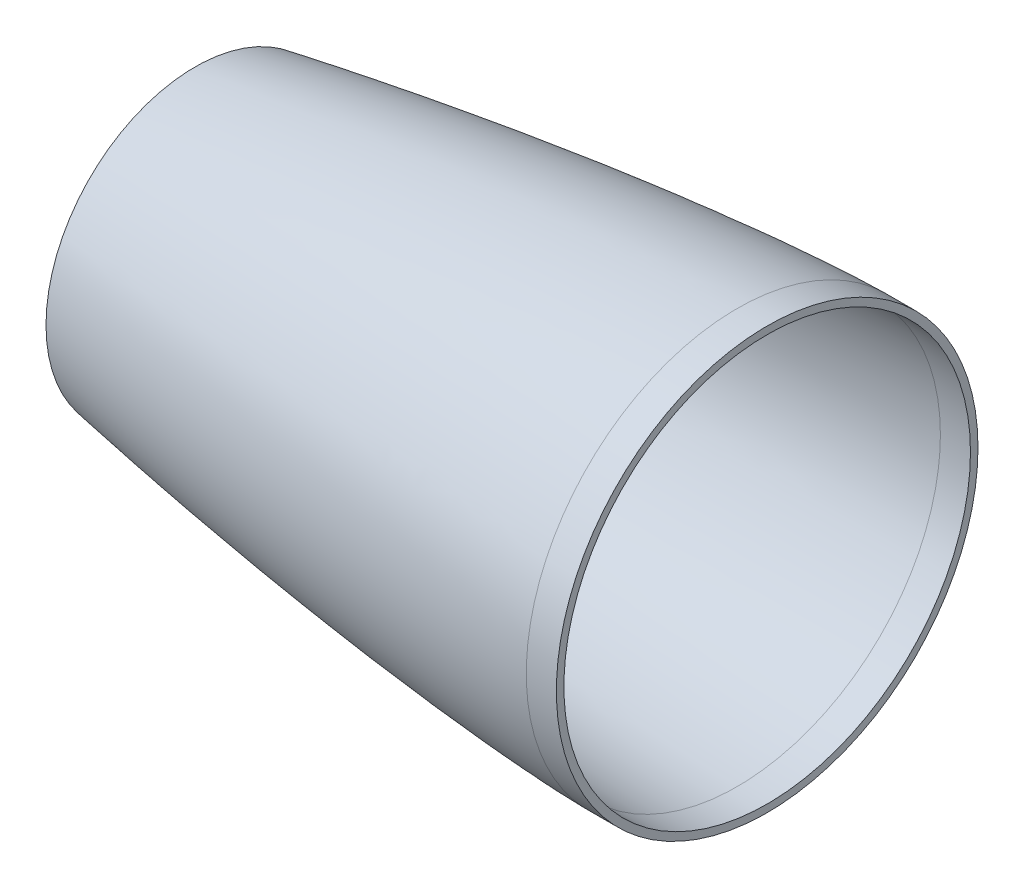
ISO-10303-21;
HEADER;
FILE_DESCRIPTION(('STEP AP214'),'2;1');
FILE_NAME('part.step','',(''),(''),'','','');
FILE_SCHEMA(('AUTOMOTIVE_DESIGN { 1 0 10303 214 1 1 1 1 }'));
ENDSEC;
DATA;
#1=APPLICATION_CONTEXT('core data for automotive mechanical design processes');
#2=APPLICATION_PROTOCOL_DEFINITION('international standard','automotive_design',2000,#1);
#3=PRODUCT_CONTEXT('',#1,'mechanical');
#4=PRODUCT('Part','Part','',(#3));
#5=PRODUCT_RELATED_PRODUCT_CATEGORY('part','',(#4));
#6=PRODUCT_DEFINITION_FORMATION('','',#4);
#7=PRODUCT_DEFINITION_CONTEXT('part definition',#1,'design');
#8=PRODUCT_DEFINITION('design','',#6,#7);
#9=PRODUCT_DEFINITION_SHAPE('','',#8);
#10=(LENGTH_UNIT() NAMED_UNIT(*) SI_UNIT(.MILLI.,.METRE.));
#11=(NAMED_UNIT(*) PLANE_ANGLE_UNIT() SI_UNIT($,.RADIAN.));
#12=(NAMED_UNIT(*) SI_UNIT($,.STERADIAN.) SOLID_ANGLE_UNIT());
#13=UNCERTAINTY_MEASURE_WITH_UNIT(LENGTH_MEASURE(1.E-05),#10,'distance_accuracy_value','');
#14=(GEOMETRIC_REPRESENTATION_CONTEXT(3) GLOBAL_UNCERTAINTY_ASSIGNED_CONTEXT((#13)) GLOBAL_UNIT_ASSIGNED_CONTEXT((#10,
#11,#12)) REPRESENTATION_CONTEXT('',''));
#15=CARTESIAN_POINT('',(0.,0.,0.));
#16=DIRECTION('',(0.,0.,1.));
#17=DIRECTION('',(1.,0.,0.));
#18=AXIS2_PLACEMENT_3D('',#15,#16,#17);
#19=CARTESIAN_POINT('',(457.2,88.9151474306752,0.));
#20=CARTESIAN_POINT('',(455.946325970131,88.9096070595816,0.));
#21=CARTESIAN_POINT('',(453.439259358558,88.8670591141968,0.));
#22=CARTESIAN_POINT('',(448.426238411328,88.7337773947161,0.));
#23=CARTESIAN_POINT('',(439.73839281718,88.3857521285292,0.));
#24=CARTESIAN_POINT('',(428.633298536274,87.7894164542894,0.));
#25=CARTESIAN_POINT('',(411.444893999551,86.6327793707619,0.));
#26=CARTESIAN_POINT('',(389.441443153579,84.7940694843695,0.));
#27=CARTESIAN_POINT('',(363.808737294308,82.2338961157606,0.));
#28=CARTESIAN_POINT('',(334.566457513105,78.8280593272444,0.));
#29=CARTESIAN_POINT('',(305.377643317541,74.992305893388,0.));
#30=CARTESIAN_POINT('',(276.244707872545,70.7535830300126,0.));
#31=CARTESIAN_POINT('',(247.171268660131,66.1243959171367,0.));
#32=CARTESIAN_POINT('',(218.162700889625,61.1047240595085,0.));
#33=CARTESIAN_POINT('',(189.226352810735,55.6834645782928,0.));
#34=CARTESIAN_POINT('',(160.373138085459,49.8354605300759,0.));
#35=CARTESIAN_POINT('',(131.618382458485,43.5190500386218,0.));
#36=CARTESIAN_POINT('',(102.986961257339,36.6637158027097,0.));
#37=CARTESIAN_POINT('',(75.2291315334263,29.34260403624,0.));
#38=CARTESIAN_POINT('',(51.2280847232855,22.2453278220032,0.));
#39=CARTESIAN_POINT('',(32.1609199731866,15.8309473459927,0.));
#40=CARTESIAN_POINT('',(18.8818526621386,10.6607161614939,0.));
#41=CARTESIAN_POINT('',(11.1356400070898,7.19917025164617,0.));
#42=CARTESIAN_POINT('',(6.41553741622741,4.76888097271789,0.));
#43=CARTESIAN_POINT('',(3.70040498934197,3.15649989124108,0.));
#44=CARTESIAN_POINT('',(2.1712436943493,2.11577541374487,0.));
#45=CARTESIAN_POINT('',(1.29726517344645,1.43712408397375,0.));
#46=CARTESIAN_POINT('',(0.796656587163147,0.996403728119644,0.));
#47=CARTESIAN_POINT('',(0.508236086993361,0.709975777371162,0.));
#48=CARTESIAN_POINT('',(0.336940369552542,0.5207345708639,0.));
#49=CARTESIAN_POINT('',(0.219057570584673,0.377905450824387,0.));
#50=CARTESIAN_POINT('',(0.133875618926122,0.263125341051019,0.));
#51=CARTESIAN_POINT('',(0.06950687304492,0.163021890873473,0.));
#52=CARTESIAN_POINT('',(0.025920332395015,0.0786931532777685,0.));
#53=CARTESIAN_POINT('',(0.00817122284619331,0.0346034081490176,0.));
#54=CARTESIAN_POINT('',(0.00225195502300941,0.0116765884656801,0.));
#55=CARTESIAN_POINT('',(0.,0.,0.));
#56=B_SPLINE_CURVE_WITH_KNOTS('',4,(#19,#20,#21,#22,#23,#24,#25,#26,#27,#28,#29,#30,#31,#32,#33,
#34,#35,#36,#37,#38,#39,#40,#41,#42,#43,#44,#45,#46,#47,#48,#49,#50,#51,#52,#53,#54,#55),
.UNSPECIFIED.,.F.,.F.,(5,1,1,1,1,1,1,1,1,1,1,1,1,1,1,1,1,1,1,1,1,1,1,1,1,1,1,1,1,1,1,1,1,5),(0.,
0.0107028585408144,0.0214057170816288,0.0428114341632575,0.0742270157557156,0.105642597348174,
0.168473764273532,0.231304932082114,0.294136099101199,0.356967264511137,0.419798428516133,
0.482629593130158,0.54546076349562,0.608291924387174,0.671123088525779,0.733954252495489,
0.796785426569319,0.859616580073358,0.916172283638337,0.947587760918424,0.968473522471574,
0.981230284106354,0.988574031772078,0.992887341044273,0.995416079253204,0.997012129469831,
0.998014752370499,0.998578001550583,0.998884285300425,0.999190569050268,0.999595284525134,
0.999797642262567,0.999898821131283,1.),.UNSPECIFIED.);
#57=CARTESIAN_POINT('',(457.2,0.,0.));
#58=DIRECTION('',(1.,0.,0.));
#59=AXIS1_PLACEMENT('',#57,#58);
#60=SURFACE_OF_REVOLUTION('',#56,#59);
#61=CARTESIAN_POINT('',(228.6,0.,0.));
#62=DIRECTION('',(1.,0.,0.));
#63=DIRECTION('',(0.,0.,-1.));
#64=AXIS2_PLACEMENT_3D('',#61,#62,#63);
#65=CIRCLE('',#64,62.8724960821944);
#66=CARTESIAN_POINT('',(228.6,0.,-62.8724960821944));
#67=VERTEX_POINT('',#66);
#68=EDGE_CURVE('E113',#67,#67,#65,.F.);
#69=ORIENTED_EDGE('',*,*,#68,.F.);
#70=EDGE_LOOP('',(#69));
#71=FACE_BOUND('',#70,.T.);
#72=CARTESIAN_POINT('',(457.2,0.,0.));
#73=DIRECTION('',(1.,0.,0.));
#74=DIRECTION('',(0.,0.,-1.));
#75=AXIS2_PLACEMENT_3D('',#72,#73,#74);
#76=CIRCLE('',#75,88.9151474306748);
#77=CARTESIAN_POINT('',(457.2,0.,-88.9151474306748));
#78=VERTEX_POINT('',#77);
#79=EDGE_CURVE('E43',#78,#78,#76,.T.);
#80=ORIENTED_EDGE('',*,*,#79,.F.);
#81=EDGE_LOOP('',(#80));
#82=FACE_BOUND('',#81,.T.);
#83=ADVANCED_FACE('F35',(#71,#82),#60,.F.);
#84=CARTESIAN_POINT('',(469.9,0.,0.));
#85=DIRECTION('',(1.,0.,0.));
#86=DIRECTION('',(0.,0.,-1.));
#87=AXIS2_PLACEMENT_3D('',#84,#85,#86);
#88=PLANE('',#87);
#89=CARTESIAN_POINT('',(469.9,0.,0.));
#90=DIRECTION('',(1.,0.,0.));
#91=DIRECTION('',(0.,0.,-1.));
#92=AXIS2_PLACEMENT_3D('',#89,#90,#91);
#93=CIRCLE('',#92,85.7401474306751);
#94=CARTESIAN_POINT('',(469.9,0.,-85.7401474306751));
#95=VERTEX_POINT('',#94);
#96=EDGE_CURVE('E47',#95,#95,#93,.T.);
#97=ORIENTED_EDGE('',*,*,#96,.F.);
#98=EDGE_LOOP('',(#97));
#99=FACE_BOUND('',#98,.T.);
#100=CARTESIAN_POINT('',(469.9,0.,0.));
#101=DIRECTION('',(1.,0.,0.));
#102=DIRECTION('',(0.,0.,-1.));
#103=AXIS2_PLACEMENT_3D('',#100,#101,#102);
#104=CIRCLE('',#103,88.9151474306753);
#105=CARTESIAN_POINT('',(469.9,0.,-88.9151474306753));
#106=VERTEX_POINT('',#105);
#107=EDGE_CURVE('E10',#106,#106,#104,.T.);
#108=ORIENTED_EDGE('',*,*,#107,.T.);
#109=EDGE_LOOP('',(#108));
#110=FACE_BOUND('',#109,.T.);
#111=ADVANCED_FACE('F78',(#99,#110),#88,.T.);
#112=CARTESIAN_POINT('',(457.2,0.,0.));
#113=DIRECTION('',(1.,0.,0.));
#114=DIRECTION('',(0.,0.,-1.));
#115=AXIS2_PLACEMENT_3D('',#112,#113,#114);
#116=CYLINDRICAL_SURFACE('',#115,88.9151474306751);
#117=ORIENTED_EDGE('',*,*,#79,.T.);
#118=EDGE_LOOP('',(#117));
#119=FACE_BOUND('',#118,.T.);
#120=ORIENTED_EDGE('',*,*,#107,.F.);
#121=EDGE_LOOP('',(#120));
#122=FACE_BOUND('',#121,.T.);
#123=ADVANCED_FACE('F76',(#119,#122),#116,.T.);
#124=CARTESIAN_POINT('',(457.2,88.9151474306752,0.));
#125=CARTESIAN_POINT('',(455.946325970131,88.9096070595816,0.));
#126=CARTESIAN_POINT('',(453.439259358558,88.8670591141968,0.));
#127=CARTESIAN_POINT('',(448.426238411328,88.7337773947161,0.));
#128=CARTESIAN_POINT('',(439.73839281718,88.3857521285292,0.));
#129=CARTESIAN_POINT('',(428.633298536274,87.7894164542894,0.));
#130=CARTESIAN_POINT('',(411.444893999551,86.6327793707619,0.));
#131=CARTESIAN_POINT('',(389.441443153579,84.7940694843695,0.));
#132=CARTESIAN_POINT('',(363.808737294308,82.2338961157606,0.));
#133=CARTESIAN_POINT('',(334.566457513105,78.8280593272444,0.));
#134=CARTESIAN_POINT('',(305.377643317541,74.992305893388,0.));
#135=CARTESIAN_POINT('',(276.244707872545,70.7535830300126,0.));
#136=CARTESIAN_POINT('',(247.171268660131,66.1243959171367,0.));
#137=CARTESIAN_POINT('',(218.162700889625,61.1047240595085,0.));
#138=CARTESIAN_POINT('',(189.226352810735,55.6834645782928,0.));
#139=CARTESIAN_POINT('',(160.373138085459,49.8354605300759,0.));
#140=CARTESIAN_POINT('',(131.618382458485,43.5190500386218,0.));
#141=CARTESIAN_POINT('',(102.986961257339,36.6637158027097,0.));
#142=CARTESIAN_POINT('',(75.2291315334263,29.34260403624,0.));
#143=CARTESIAN_POINT('',(51.2280847232855,22.2453278220032,0.));
#144=CARTESIAN_POINT('',(32.1609199731866,15.8309473459927,0.));
#145=CARTESIAN_POINT('',(18.8818526621386,10.6607161614939,0.));
#146=CARTESIAN_POINT('',(11.1356400070898,7.19917025164617,0.));
#147=CARTESIAN_POINT('',(6.56443195126468,4.84554388103954,0.));
#148=CARTESIAN_POINT('',(4.24353193294884,3.47834755188173,0.));
#149=CARTESIAN_POINT('',(3.23765947503868,2.82723498943833,0.));
#150=CARTESIAN_POINT('',(2.95679087341137,2.63945943168812,0.));
#151=B_SPLINE_CURVE_WITH_KNOTS('',4,(#124,#125,#126,#127,#128,#129,#130,#131,#132,#133,#134,
#135,#136,#137,#138,#139,#140,#141,#142,#143,#144,#145,#146,#147,#148,#149,#150),.UNSPECIFIED.,
.F.,.F.,(5,1,1,1,1,1,1,1,1,1,1,1,1,1,1,1,1,1,1,1,1,1,1,5),(0.,0.0107028585408144,
0.0214057170816288,0.0428114341632575,0.0742270157557156,0.105642597348174,0.168473764273532,
0.231304932082114,0.294136099101199,0.356967264511137,0.419798428516133,0.482629593130158,
0.54546076349562,0.608291924387174,0.671123088525779,0.733954252495489,0.796785426569319,
0.859616580073358,0.916172283638337,0.947587760918424,0.968473522471574,0.981230284106354,
0.988574031772078,0.991458376357514),.UNSPECIFIED.);
#152=CARTESIAN_POINT('',(457.2,0.,0.));
#153=DIRECTION('',(1.,0.,0.));
#154=AXIS1_PLACEMENT('',#152,#153);
#155=SURFACE_OF_REVOLUTION('',#151,#154);
#156=OFFSET_SURFACE('',#155,3.175,.F.);
#157=CARTESIAN_POINT('',(228.6,0.,0.));
#158=DIRECTION('',(1.,0.,0.));
#159=DIRECTION('',(0.,0.,-1.));
#160=AXIS2_PLACEMENT_3D('',#157,#158,#159);
#161=CIRCLE('',#160,59.6491220098759);
#162=CARTESIAN_POINT('',(228.6,0.,-59.6491220098759));
#163=VERTEX_POINT('',#162);
#164=EDGE_CURVE('E39',#163,#163,#161,.F.);
#165=ORIENTED_EDGE('',*,*,#164,.T.);
#166=EDGE_LOOP('',(#165));
#167=FACE_BOUND('',#166,.T.);
#168=CARTESIAN_POINT('',(457.214031164219,0.,-85.7401784345383));
#169=CARTESIAN_POINT('',(457.214031164152,1.40292180575902,-85.7402081939915));
#170=CARTESIAN_POINT('',(457.214031164156,2.80584107928027,-85.7057466471904));
#171=CARTESIAN_POINT('',(457.214031164201,5.60830122533601,-85.5680546220737));
#172=CARTESIAN_POINT('',(457.214031164242,7.00784209787054,-85.4648241437591));
#173=CARTESIAN_POINT('',(457.214031164254,9.8001721053742,-85.1898079366197));
#174=CARTESIAN_POINT('',(457.214031164225,11.1929612403438,-85.0180222078003));
#175=CARTESIAN_POINT('',(457.214031164187,13.9684328828145,-84.6063187274703));
#176=CARTESIAN_POINT('',(457.214031164177,15.3511153903144,-84.3664009759524));
#177=CARTESIAN_POINT('',(457.214031164188,18.1030426508934,-83.819008919495));
#178=CARTESIAN_POINT('',(457.214031164207,19.4722874039728,-83.5115346145577));
#179=CARTESIAN_POINT('',(457.214031164205,22.1940405581952,-82.8297708573391));
#180=CARTESIAN_POINT('',(457.214031164183,23.5465489593396,-82.455481405063));
#181=CARTESIAN_POINT('',(457.214031164191,26.2315710898439,-81.6409888687209));
#182=CARTESIAN_POINT('',(457.21403116422,27.5640848192022,-81.2007857846493));
#183=CARTESIAN_POINT('',(457.214031164236,30.2059074660631,-80.2555265208975));
#184=CARTESIAN_POINT('',(457.214031164222,31.5152163835665,-79.7504703412193));
#185=CARTESIAN_POINT('',(457.214031164207,34.1074751662925,-78.6767215978475));
#186=CARTESIAN_POINT('',(457.214031164205,35.3904250315145,-78.1080290341522));
#187=CARTESIAN_POINT('',(457.214031164213,37.9268749711856,-76.9083775564403));
#188=CARTESIAN_POINT('',(457.214031164222,39.1803750456353,-76.2774186424251));
#189=CARTESIAN_POINT('',(457.214031164226,41.6549056122618,-74.9547544984277));
#190=CARTESIAN_POINT('',(457.214031164222,42.875936104439,-74.2630492684461));
#191=CARTESIAN_POINT('',(457.214031164224,45.2825859371492,-72.8205588712398));
#192=CARTESIAN_POINT('',(457.21403116423,46.4682052776819,-72.0697737040148));
#193=CARTESIAN_POINT('',(457.214031164238,48.801176546257,-70.5109321394844));
#194=CARTESIAN_POINT('',(457.21403116424,49.9485284742991,-69.7028757421787));
#195=CARTESIAN_POINT('',(457.214031164227,52.2022008466007,-68.031438396144));
#196=CARTESIAN_POINT('',(457.214031164211,53.3085212908599,-67.1680574474147));
#197=CARTESIAN_POINT('',(457.214031164204,55.4774654727964,-65.3880509588123));
#198=CARTESIAN_POINT('',(457.214031164213,56.5400892104713,-64.4714254189364));
#199=CARTESIAN_POINT('',(457.214031164226,58.6190800254749,-62.587137979335));
#200=CARTESIAN_POINT('',(457.21403116423,59.6354471028056,-61.6194760796117));
#201=CARTESIAN_POINT('',(457.214031164225,61.6194760798162,-59.635447102593));
#202=CARTESIAN_POINT('',(457.214031164215,62.587137979498,-58.6190800252996));
#203=CARTESIAN_POINT('',(457.214031164224,64.4714254189735,-56.5400892104259));
#204=CARTESIAN_POINT('',(457.214031164242,65.3880509587675,-55.477465472846));
#205=CARTESIAN_POINT('',(457.214031164246,67.168057447352,-53.3085212909419));
#206=CARTESIAN_POINT('',(457.214031164234,68.0314383961372,-52.2022008466134));
#207=CARTESIAN_POINT('',(457.214031164234,69.7028757422058,-49.948528474259));
#208=CARTESIAN_POINT('',(457.214031164246,70.5109321394939,-48.8011765462365));
#209=CARTESIAN_POINT('',(457.214031164222,72.0697737040188,-46.4682052776822));
#210=CARTESIAN_POINT('',(457.214031164185,72.8205588712549,-45.2825859371499));
#211=CARTESIAN_POINT('',(457.21403116418,74.2630492684307,-42.8759361044382));
#212=CARTESIAN_POINT('',(457.214031164213,74.9547544983708,-41.6549056122591));
#213=CARTESIAN_POINT('',(457.214031164235,76.2774186424902,-39.1803750456226));
#214=CARTESIAN_POINT('',(457.214031164225,76.9083775566681,-37.9268749711645));
#215=CARTESIAN_POINT('',(457.214031164214,78.1080290339546,-35.390425031472));
#216=CARTESIAN_POINT('',(457.214031164212,78.6767215970634,-34.1074751662375));
#217=CARTESIAN_POINT('',(457.214031164216,79.7504703420046,-31.5152163836184));
#218=CARTESIAN_POINT('',(457.214031164221,80.2555265238385,-30.2059074662343));
#219=CARTESIAN_POINT('',(457.214031164234,81.2007857816874,-27.5640848190895));
#220=CARTESIAN_POINT('',(457.214031164242,81.6409888576994,-26.2315710893277));
#221=CARTESIAN_POINT('',(457.214031164229,82.4554814160957,-23.5465489598204));
#222=CARTESIAN_POINT('',(457.214031164207,82.829770898482,-22.1940405600756));
#223=CARTESIAN_POINT('',(457.214031164206,83.5115345734853,-19.4722874018107));
#224=CARTESIAN_POINT('',(457.214031164227,83.8190087661047,-18.1030426432913));
#225=CARTESIAN_POINT('',(457.21403116423,84.3664011293389,-15.3511153979372));
#226=CARTESIAN_POINT('',(457.214031164211,84.6063192999514,-13.9684329111021));
#227=CARTESIAN_POINT('',(457.2140311642,85.0180216352834,-11.1929612122972));
#228=CARTESIAN_POINT('',(457.214031164208,85.1898057999989,-9.80017200032687));
#229=CARTESIAN_POINT('',(457.214031164194,85.4648262804035,-7.00784220267474));
#230=CARTESIAN_POINT('',(457.214031164171,85.5680625960991,-5.60830161699361));
#231=CARTESIAN_POINT('',(457.214031164186,85.705738673169,-2.80584068754182));
#232=CARTESIAN_POINT('',(457.214031164223,85.7401784345383,-1.40292034377093));
#233=CARTESIAN_POINT('',(457.214031164216,85.7401784345383,1.40292034377059));
#234=CARTESIAN_POINT('',(457.214031164173,85.705738673169,2.80584068754121));
#235=CARTESIAN_POINT('',(457.214031164185,85.5680625960952,5.60830161707506));
#236=CARTESIAN_POINT('',(457.214031164241,85.4648262803916,7.00784220283834));
#237=CARTESIAN_POINT('',(457.214031164255,85.1898057999872,9.80017200040711));
#238=CARTESIAN_POINT('',(457.214031164214,85.0180216352918,11.1929612122132));
#239=CARTESIAN_POINT('',(457.214031164198,84.6063192999911,13.9684329108618));
#240=CARTESIAN_POINT('',(457.214031164224,84.3664011293815,15.3511153977037));
#241=CARTESIAN_POINT('',(457.214031164233,83.8190087661229,18.1030426432196));
#242=CARTESIAN_POINT('',(457.214031164216,83.511534573469,19.4722874018924));
#243=CARTESIAN_POINT('',(457.214031164197,82.8297708984407,22.1940405602243));
#244=CARTESIAN_POINT('',(457.214031164196,82.4554814160754,23.5465489598856));
#245=CARTESIAN_POINT('',(457.214031164185,81.6409888577049,26.2315710893096));
#246=CARTESIAN_POINT('',(457.214031164174,81.2007857816935,27.5640848190705));
#247=CARTESIAN_POINT('',(457.214031164185,80.2555265238434,30.2059074662212));
#248=CARTESIAN_POINT('',(457.214031164208,79.7504703420073,31.5152163836119));
#249=CARTESIAN_POINT('',(457.21403116422,78.6767215970635,34.1074751662374));
#250=CARTESIAN_POINT('',(457.21403116421,78.1080290339547,35.3904250314718));
#251=CARTESIAN_POINT('',(457.214031164208,76.9083775566764,37.9268749711467));
#252=CARTESIAN_POINT('',(457.214031164216,76.2774186425078,39.1803750455876));
#253=CARTESIAN_POINT('',(457.214031164232,74.9547544983902,41.6549056122251));
#254=CARTESIAN_POINT('',(457.21403116424,74.263049268441,42.8759361044215));
#255=CARTESIAN_POINT('',(457.21403116423,72.8205588712315,45.2825859371893));
#256=CARTESIAN_POINT('',(457.21403116421,72.0697737039697,46.4682052777596));
#257=CARTESIAN_POINT('',(457.214031164179,70.5109321394177,48.801176546346));
#258=CARTESIAN_POINT('',(457.214031164168,69.7028757421303,49.9485284743638));
#259=CARTESIAN_POINT('',(457.214031164196,68.0314383961463,52.2022008465974));
#260=CARTESIAN_POINT('',(457.214031164237,67.1680574474506,53.3085212908139));
#261=CARTESIAN_POINT('',(457.214031164251,65.3880509589567,55.4774654726234));
#262=CARTESIAN_POINT('',(457.214031164226,64.4714254191579,56.5400892102159));
#263=CARTESIAN_POINT('',(457.214031164214,62.5871379795815,58.619080025214));
#264=CARTESIAN_POINT('',(457.214031164226,61.6194760797985,59.6354471026148));
#265=CARTESIAN_POINT('',(457.214031164228,59.635447102658,61.6194760797552));
#266=CARTESIAN_POINT('',(457.214031164217,58.6190800253027,62.587137979497));
#267=CARTESIAN_POINT('',(457.214031164223,56.5400892103365,64.4714254190526));
#268=CARTESIAN_POINT('',(457.214031164241,55.4774654727277,65.3880509588686));
#269=CARTESIAN_POINT('',(457.214031164247,53.3085212908924,67.1680574473886));
#270=CARTESIAN_POINT('',(457.214031164237,52.2022008466666,68.0314383960937));
#271=CARTESIAN_POINT('',(457.214031164231,49.9485284743674,69.7028757421295));
#272=CARTESIAN_POINT('',(457.214031164235,48.8011765462916,70.510932139457));
#273=CARTESIAN_POINT('',(457.214031164232,46.4682052776646,72.0697737040306));
#274=CARTESIAN_POINT('',(457.214031164224,45.2825859371142,72.8205588712777));
#275=CARTESIAN_POINT('',(457.214031164221,42.8759361043848,74.2630492684617));
#276=CARTESIAN_POINT('',(457.214031164226,41.6549056122065,74.9547544984));
#277=CARTESIAN_POINT('',(457.214031164222,39.1803750455878,76.2774186425077));
#278=CARTESIAN_POINT('',(457.214031164213,37.9268749711469,76.9083775566763));
#279=CARTESIAN_POINT('',(457.214031164206,35.390425031472,78.1080290339546));
#280=CARTESIAN_POINT('',(457.214031164208,34.1074751662375,78.6767215970634));
#281=CARTESIAN_POINT('',(457.21403116422,31.5152163836184,79.7504703420047));
#282=CARTESIAN_POINT('',(457.214031164231,30.2059074662343,80.2555265238385));
#283=CARTESIAN_POINT('',(457.214031164217,27.5640848190782,81.2007857816914));
#284=CARTESIAN_POINT('',(457.214031164193,26.231571089305,81.6409888577067));
#285=CARTESIAN_POINT('',(457.214031164181,23.5465489598741,82.4554814160785));
#286=CARTESIAN_POINT('',(457.214031164194,22.1940405602187,82.829770898442));
#287=CARTESIAN_POINT('',(457.214031164219,19.4722874019634,83.5115345734512));
#288=CARTESIAN_POINT('',(457.21403116423,18.1030426433621,83.8190087660909));
#289=CARTESIAN_POINT('',(457.214031164227,15.3511153978507,84.3664011293559));
#290=CARTESIAN_POINT('',(457.214031164213,13.9684329109401,84.6063192999794));
#291=CARTESIAN_POINT('',(457.214031164197,11.192961212137,85.0180216353032));
#292=CARTESIAN_POINT('',(457.214031164195,9.80017200024503,85.189805800007));
#293=CARTESIAN_POINT('',(457.214031164207,7.0078422025906,85.4648262804117));
#294=CARTESIAN_POINT('',(457.214031164219,5.60830161682807,85.5680625961115));
#295=CARTESIAN_POINT('',(457.214031164232,2.80584068737689,85.7057386731733));
#296=CARTESIAN_POINT('',(457.214031164232,1.4029203436884,85.7401784345384));
#297=CARTESIAN_POINT('',(457.214031164207,-1.40292034377093,85.7401784345382));
#298=CARTESIAN_POINT('',(457.214031164182,-2.80584068754178,85.705738673169));
#299=CARTESIAN_POINT('',(457.214031164175,-5.60830161699352,85.5680625960991));
#300=CARTESIAN_POINT('',(457.214031164191,-7.00784220267466,85.4648262804034));
#301=CARTESIAN_POINT('',(457.21403116421,-9.80017200024699,85.1898058000068));
#302=CARTESIAN_POINT('',(457.214031164213,-11.1929612121379,85.0180216353032));
#303=CARTESIAN_POINT('',(457.214031164199,-13.9684329109439,84.6063192999788));
#304=CARTESIAN_POINT('',(457.214031164183,-15.3511153978585,84.3664011293543));
#305=CARTESIAN_POINT('',(457.214031164181,-18.1030426433649,83.8190087660899));
#306=CARTESIAN_POINT('',(457.214031164194,-19.4722874019572,83.5115345734524));
#307=CARTESIAN_POINT('',(457.214031164219,-22.1940405602853,82.8297708984257));
#308=CARTESIAN_POINT('',(457.21403116423,-23.5465489600214,82.4554814160381));
#309=CARTESIAN_POINT('',(457.214031164235,-26.2315710894482,81.6409888576594));
#310=CARTESIAN_POINT('',(457.214031164229,-27.5640848191392,81.2007857816692));
#311=CARTESIAN_POINT('',(457.214031164219,-30.2059074662781,80.2555265238232));
#312=CARTESIAN_POINT('',(457.214031164214,-31.5152163837247,79.7504703419638));
#313=CARTESIAN_POINT('',(457.214031164214,-34.107475166348,78.6767215970145));
#314=CARTESIAN_POINT('',(457.214031164217,-35.3904250315265,78.1080290339288));
#315=CARTESIAN_POINT('',(457.214031164221,-37.9268749711468,76.9083775566764));
#316=CARTESIAN_POINT('',(457.214031164221,-39.1803750455876,76.2774186425078));
#317=CARTESIAN_POINT('',(457.214031164226,-41.6549056122064,74.9547544984001));
#318=CARTESIAN_POINT('',(457.214031164231,-42.8759361043846,74.2630492684618));
#319=CARTESIAN_POINT('',(457.214031164215,-45.2825859371338,72.8205588712659));
#320=CARTESIAN_POINT('',(457.214031164193,-46.4682052777032,72.069773704006));
#321=CARTESIAN_POINT('',(457.214031164196,-48.8011765464046,70.51093213938));
#322=CARTESIAN_POINT('',(457.21403116422,-49.9485284745346,69.702875742011));
#323=CARTESIAN_POINT('',(457.214031164247,-52.2022008467891,68.0314383959974));
#324=CARTESIAN_POINT('',(457.21403116425,-53.3085212909213,67.1680574473632));
#325=CARTESIAN_POINT('',(457.214031164238,-55.477465472688,65.3880509589028));
#326=CARTESIAN_POINT('',(457.214031164222,-56.5400892103171,64.4714254190702));
#327=CARTESIAN_POINT('',(457.214031164217,-58.619080025346,62.5871379794578));
#328=CARTESIAN_POINT('',(457.214031164228,-59.6354471027426,61.6194760796747));
#329=CARTESIAN_POINT('',(457.214031164227,-61.6194760798357,59.6354471025735));
#330=CARTESIAN_POINT('',(457.214031164215,-62.5871379795362,58.6190800252595));
#331=CARTESIAN_POINT('',(457.214031164224,-64.4714254190526,56.5400892103366));
#332=CARTESIAN_POINT('',(457.214031164244,-65.3880509588686,55.4774654727278));
#333=CARTESIAN_POINT('',(457.214031164244,-67.1680574474042,53.3085212908734));
#334=CARTESIAN_POINT('',(457.214031164223,-68.0314383961239,52.2022008466279));
#335=CARTESIAN_POINT('',(457.214031164217,-69.702875742144,49.9485284743456));
#336=CARTESIAN_POINT('',(457.214031164232,-70.5109321394442,48.8011765463087));
#337=CARTESIAN_POINT('',(457.214031164236,-72.0697737040061,46.4682052777034));
#338=CARTESIAN_POINT('',(457.214031164225,-72.8205588712659,45.2825859371339));
#339=CARTESIAN_POINT('',(457.21403116422,-74.2630492684617,42.8759361043847));
#340=CARTESIAN_POINT('',(457.214031164226,-74.9547544984001,41.6549056122065));
#341=CARTESIAN_POINT('',(457.214031164222,-76.2774186424994,39.1803750456033));
#342=CARTESIAN_POINT('',(457.214031164212,-76.9083775566605,37.9268749711784));
#343=CARTESIAN_POINT('',(457.214031164207,-78.1080290339077,35.3904250315732));
#344=CARTESIAN_POINT('',(457.214031164211,-78.6767215969949,34.1074751663933));
#345=CARTESIAN_POINT('',(457.214031164217,-79.7504703419471,31.5152163837672));
#346=CARTESIAN_POINT('',(457.214031164218,-80.2555265238078,30.2059074663191));
#347=CARTESIAN_POINT('',(457.21403116423,-81.200785781685,27.564084819097));
#348=CARTESIAN_POINT('',(457.214031164241,-81.6409888577011,26.231571089323));
#349=CARTESIAN_POINT('',(457.21403116423,-82.4554814160974,23.5465489598137));
#350=CARTESIAN_POINT('',(457.214031164207,-82.8297708984808,22.1940405600795));
#351=CARTESIAN_POINT('',(457.214031164206,-83.5115345735028,19.472287401742));
#352=CARTESIAN_POINT('',(457.214031164227,-83.8190087661393,18.1030426431381));
#353=CARTESIAN_POINT('',(457.21403116423,-84.3664011293825,15.3511153976974));
#354=CARTESIAN_POINT('',(457.214031164212,-84.6063192999912,13.9684329108609));
#355=CARTESIAN_POINT('',(457.2140311642,-85.0180216353035,11.192961212135));
#356=CARTESIAN_POINT('',(457.214031164207,-85.1898058000069,9.80017200024558));
#357=CARTESIAN_POINT('',(457.214031164195,-85.4648262804035,7.00784220267451));
#358=CARTESIAN_POINT('',(457.214031164175,-85.5680625960992,5.60830161699312));
#359=CARTESIAN_POINT('',(457.214031164182,-85.705738673169,2.80584068754138));
#360=CARTESIAN_POINT('',(457.21403116421,-85.7401784345383,1.40292034377079));
#361=CARTESIAN_POINT('',(457.214031164228,-85.7401784345383,-1.40292034377078));
#362=CARTESIAN_POINT('',(457.214031164219,-85.7057386731692,-2.80584068754177));
#363=CARTESIAN_POINT('',(457.214031164232,-85.5680625960954,-5.60830161707567));
#364=CARTESIAN_POINT('',(457.214031164253,-85.4648262803916,-7.00784220283862));
#365=CARTESIAN_POINT('',(457.214031164242,-85.1898057999791,-9.80017200048845));
#366=CARTESIAN_POINT('',(457.21403116421,-85.0180216352718,-11.1929612123755));
#367=CARTESIAN_POINT('',(457.214031164202,-84.6063192999638,-13.9684329110189));
#368=CARTESIAN_POINT('',(457.214031164227,-84.3664011293669,-15.351115397776));
#369=CARTESIAN_POINT('',(457.214031164229,-83.8190087661403,-18.1030426431331));
#370=CARTESIAN_POINT('',(457.214031164207,-83.511534573505,-19.4722874017321));
#371=CARTESIAN_POINT('',(457.214031164207,-82.8297708984749,-22.194040560104));
#372=CARTESIAN_POINT('',(457.21403116423,-82.4554814160801,-23.5465489598768));
#373=CARTESIAN_POINT('',(457.214031164241,-81.6409888576675,-26.2315710894281));
#374=CARTESIAN_POINT('',(457.21403116423,-81.2007857816481,-27.5640848192061));
#375=CARTESIAN_POINT('',(457.214031164218,-80.2555265237868,-30.2059074663719));
#376=CARTESIAN_POINT('',(457.214031164217,-79.7504703419484,-31.515216383761));
#377=CARTESIAN_POINT('',(457.214031164211,-78.6767215970509,-34.1074751662611));
#378=CARTESIAN_POINT('',(457.214031164207,-78.1080290339966,-35.390425031374));
#379=CARTESIAN_POINT('',(457.214031164212,-76.9083775567495,-37.9268749710013));
#380=CARTESIAN_POINT('',(457.214031164221,-76.2774186425482,-39.1803750455117));
#381=CARTESIAN_POINT('',(457.214031164226,-74.9547544983703,-41.6549056122626));
#382=CARTESIAN_POINT('',(457.214031164222,-74.2630492683944,-42.8759361045037));
#383=CARTESIAN_POINT('',(457.214031164224,-72.8205588712018,-45.2825859372341));
#384=CARTESIAN_POINT('',(457.21403116423,-72.0697737039896,-46.4682052777261));
#385=CARTESIAN_POINT('',(457.214031164212,-70.5109321394281,-48.8011765463345));
#386=CARTESIAN_POINT('',(457.214031164187,-69.702875742073,-49.948528474447));
#387=CARTESIAN_POINT('',(457.214031164205,-68.031438396021,-52.2022008467605));
#388=CARTESIAN_POINT('',(457.214031164247,-67.1680574473298,-53.3085212909658));
#389=CARTESIAN_POINT('',(457.21403116424,-65.3880509588049,-55.4774654728035));
#390=CARTESIAN_POINT('',(457.214031164191,-64.4714254189682,-56.5400892104334));
#391=CARTESIAN_POINT('',(457.214031164179,-62.5871379794242,-58.6190800253789));
#392=CARTESIAN_POINT('',(457.214031164216,-61.6194760797179,-59.6354471026953));
#393=CARTESIAN_POINT('',(457.214031164238,-59.6354471026954,-61.6194760797179));
#394=CARTESIAN_POINT('',(457.214031164223,-58.6190800253792,-62.5871379794242));
#395=CARTESIAN_POINT('',(457.214031164216,-56.5400892104336,-64.4714254189682));
#396=CARTESIAN_POINT('',(457.214031164225,-55.4774654728035,-65.3880509588052));
#397=CARTESIAN_POINT('',(457.214031164233,-53.3085212909657,-67.1680574473295));
#398=CARTESIAN_POINT('',(457.214031164233,-52.2022008467606,-68.0314383960199));
#399=CARTESIAN_POINT('',(457.214031164234,-49.9485284744841,-69.702875742047));
#400=CARTESIAN_POINT('',(457.214031164236,-48.8011765464097,-70.5109321393795));
#401=CARTESIAN_POINT('',(457.214031164231,-46.4682052777856,-72.0697737039483));
#402=CARTESIAN_POINT('',(457.214031164224,-45.2825859372368,-72.8205588711858));
#403=CARTESIAN_POINT('',(457.214031164222,-42.8759361044678,-74.2630492684304));
#404=CARTESIAN_POINT('',(457.214031164226,-41.6549056122471,-74.9547544984368));
#405=CARTESIAN_POINT('',(457.214031164222,-39.1803750455752,-76.277418642456));
#406=CARTESIAN_POINT('',(457.214031164213,-37.9268749711247,-76.9083775564703));
#407=CARTESIAN_POINT('',(457.214031164206,-35.390425031438,-78.1080290341872));
#408=CARTESIAN_POINT('',(457.214031164208,-34.1074751662007,-78.6767215978876));
#409=CARTESIAN_POINT('',(457.21403116422,-31.515216383485,-79.750470341251));
#410=CARTESIAN_POINT('',(457.21403116423,-30.2059074660081,-80.2555265209177));
#411=CARTESIAN_POINT('',(457.214031164218,-27.5640848192279,-81.2007857846396));
#412=CARTESIAN_POINT('',(457.214031164196,-26.2315710899243,-81.6409888686941));
#413=CARTESIAN_POINT('',(457.214031164185,-23.5465489594029,-82.4554814050462));
#414=CARTESIAN_POINT('',(457.214031164195,-22.1940405581849,-82.8297708573431));
#415=CARTESIAN_POINT('',(457.214031164218,-19.4722874038746,-83.5115346145808));
#416=CARTESIAN_POINT('',(457.21403116423,-18.1030426507819,-83.8190089195195));
#417=CARTESIAN_POINT('',(457.214031164227,-15.3511153903379,-84.3664009759458));
#418=CARTESIAN_POINT('',(457.214031164211,-13.9684328829879,-84.6063187274393));
#419=CARTESIAN_POINT('',(457.214031164201,-11.1929612404991,-85.0180222077826));
#420=CARTESIAN_POINT('',(457.214031164206,-9.80017210535915,-85.1898079366241));
#421=CARTESIAN_POINT('',(457.214031164196,-7.00784209767349,-85.4648241437752));
#422=CARTESIAN_POINT('',(457.214031164182,-5.60830122512807,-85.5680546220875));
#423=CARTESIAN_POINT('',(457.214031164175,-2.80584107913435,-85.7057466471941));
#424=CARTESIAN_POINT('',(457.214031164182,-1.4029218056862,-85.7402081939916));
#425=CARTESIAN_POINT('',(457.214031164219,-2.17834338147942E-13,-85.7401784345383));
#426=B_SPLINE_CURVE_WITH_KNOTS('',3,(#168,#169,#170,#171,#172,#173,#174,#175,#176,#177,#178,
#179,#180,#181,#182,#183,#184,#185,#186,#187,#188,#189,#190,#191,#192,#193,#194,#195,#196,#197,
#198,#199,#200,#201,#202,#203,#204,#205,#206,#207,#208,#209,#210,#211,#212,#213,#214,#215,#216,
#217,#218,#219,#220,#221,#222,#223,#224,#225,#226,#227,#228,#229,#230,#231,#232,#233,#234,#235,
#236,#237,#238,#239,#240,#241,#242,#243,#244,#245,#246,#247,#248,#249,#250,#251,#252,#253,#254,
#255,#256,#257,#258,#259,#260,#261,#262,#263,#264,#265,#266,#267,#268,#269,#270,#271,#272,#273,
#274,#275,#276,#277,#278,#279,#280,#281,#282,#283,#284,#285,#286,#287,#288,#289,#290,#291,#292,
#293,#294,#295,#296,#297,#298,#299,#300,#301,#302,#303,#304,#305,#306,#307,#308,#309,#310,#311,
#312,#313,#314,#315,#316,#317,#318,#319,#320,#321,#322,#323,#324,#325,#326,#327,#328,#329,#330,
#331,#332,#333,#334,#335,#336,#337,#338,#339,#340,#341,#342,#343,#344,#345,#346,#347,#348,#349,
#350,#351,#352,#353,#354,#355,#356,#357,#358,#359,#360,#361,#362,#363,#364,#365,#366,#367,#368,
#369,#370,#371,#372,#373,#374,#375,#376,#377,#378,#379,#380,#381,#382,#383,#384,#385,#386,#387,
#388,#389,#390,#391,#392,#393,#394,#395,#396,#397,#398,#399,#400,#401,#402,#403,#404,#405,#406,
#407,#408,#409,#410,#411,#412,#413,#414,#415,#416,#417,#418,#419,#420,#421,#422,#423,#424,#425),
.UNSPECIFIED.,.F.,.F.,(4,2,2,2,2,2,2,2,2,2,2,2,2,2,2,2,2,2,2,2,2,2,2,2,2,2,2,2,2,2,2,2,2,2,2,2,
2,2,2,2,2,2,2,2,2,2,2,2,2,2,2,2,2,2,2,2,2,2,2,2,2,2,2,2,2,2,2,2,2,2,2,2,2,2,2,2,2,2,2,2,2,2,2,2,
2,2,2,2,2,2,2,2,2,2,2,2,2,2,2,2,2,2,2,2,2,2,2,2,2,2,2,2,2,2,2,2,2,2,2,2,2,2,2,2,2,2,2,2,4),(0.,
4.20833862523187,8.41667725040577,12.6250158752592,16.8333545005713,21.0416931257527,
25.2500317506089,29.4583703758219,33.6667090009041,37.875047626094,42.0833862511848,
46.2917248762336,50.5000635013123,54.7084021264103,58.9167407515211,63.1250793768525,
67.3334180020082,71.5417566269971,75.7500952519531,79.9584338773292,84.1667725023536,
88.3751111274323,92.583449752481,96.7917883776248,101.000127002762,105.208465627802,
109.416804253039,113.625142878139,117.833481503083,122.041820128166,126.250158753503,
130.458497378434,134.666836003666,138.875174628897,143.083513254075,147.291851878916,
151.500190504018,155.708529129434,159.916867754275,164.125206379509,168.33354500457,
172.541883629707,176.750222254792,180.958560879899,185.166899505116,189.375238130128,
193.583576755074,197.791915380068,202.000254005499,206.208592630746,210.416931255811,
214.625269880796,218.833608506019,223.041947131162,227.250285756205,231.458624381291,
235.666963006427,239.875301631468,244.083640256741,248.291978881564,252.500317506761,
256.708656132073,260.916994757173,265.125333382347,269.333672007332,273.542010632564,
277.750349257494,281.958687882591,286.167026507915,290.375365133084,294.58370375816,
298.792042383175,303.000381008417,307.208719633373,311.417058258458,315.625396883502,
319.833735508713,324.04207413414,328.250412758774,332.458751383918,336.66709000934,
340.875428634412,345.083767259476,349.292105884536,353.500444509617,357.708783134828,
361.917121759871,366.125460384904,370.333799009865,374.542137635113,378.750476260389,
382.958814885455,387.167153510657,391.375492135743,395.583830760835,399.792169385767,
404.000508010998,408.20884663623,412.417185261406,416.625523886493,420.833862511338,
425.042201136525,429.250539761712,433.458878387002,437.667217012062,441.875555636799,
446.083894262115,450.292232887377,454.500571512316,458.708910137677,462.917248762588,
467.125587387741,471.333926012831,475.54226463792,479.750603263073,483.958941887984,
488.167280513208,492.375619138347,496.583957763546,500.792296388638,505.000635013876,
509.208973638871,513.417312263913,517.625650888999,521.83398951422,526.042328139077,
530.250666764445,534.459005389651,538.667344014663),.UNSPECIFIED.);
#427=CARTESIAN_POINT('',(457.214031164219,0.,-85.7401784345383));
#428=VERTEX_POINT('',#427);
#429=EDGE_CURVE('E58',#428,#428,#426,.T.);
#430=ORIENTED_EDGE('',*,*,#429,.T.);
#431=EDGE_LOOP('',(#430));
#432=FACE_BOUND('',#431,.T.);
#433=ADVANCED_FACE('F73',(#167,#432),#156,.T.);
#434=CARTESIAN_POINT('',(457.2,0.,0.));
#435=DIRECTION('',(1.,0.,0.));
#436=DIRECTION('',(0.,0.,-1.));
#437=AXIS2_PLACEMENT_3D('',#434,#435,#436);
#438=CYLINDRICAL_SURFACE('',#437,85.7401474306751);
#439=ORIENTED_EDGE('',*,*,#429,.F.);
#440=EDGE_LOOP('',(#439));
#441=FACE_BOUND('',#440,.T.);
#442=ORIENTED_EDGE('',*,*,#96,.T.);
#443=EDGE_LOOP('',(#442));
#444=FACE_BOUND('',#443,.T.);
#445=ADVANCED_FACE('F88',(#441,#444),#438,.F.);
#446=CARTESIAN_POINT('',(228.6,0.,0.));
#447=DIRECTION('',(1.,0.,0.));
#448=DIRECTION('',(0.,0.,-1.));
#449=AXIS2_PLACEMENT_3D('',#446,#447,#448);
#450=PLANE('',#449);
#451=ORIENTED_EDGE('',*,*,#68,.T.);
#452=EDGE_LOOP('',(#451));
#453=FACE_BOUND('',#452,.T.);
#454=ORIENTED_EDGE('',*,*,#164,.F.);
#455=EDGE_LOOP('',(#454));
#456=FACE_BOUND('',#455,.T.);
#457=ADVANCED_FACE('F90',(#453,#456),#450,.F.);
#458=CLOSED_SHELL('',(#83,#111,#123,#433,#445,#457));
#459=MANIFOLD_SOLID_BREP('B2',#458);
#460=ADVANCED_BREP_SHAPE_REPRESENTATION('',(#18,#459),#14);
#461=SHAPE_DEFINITION_REPRESENTATION(#9,#460);
ENDSEC;
END-ISO-10303-21;
